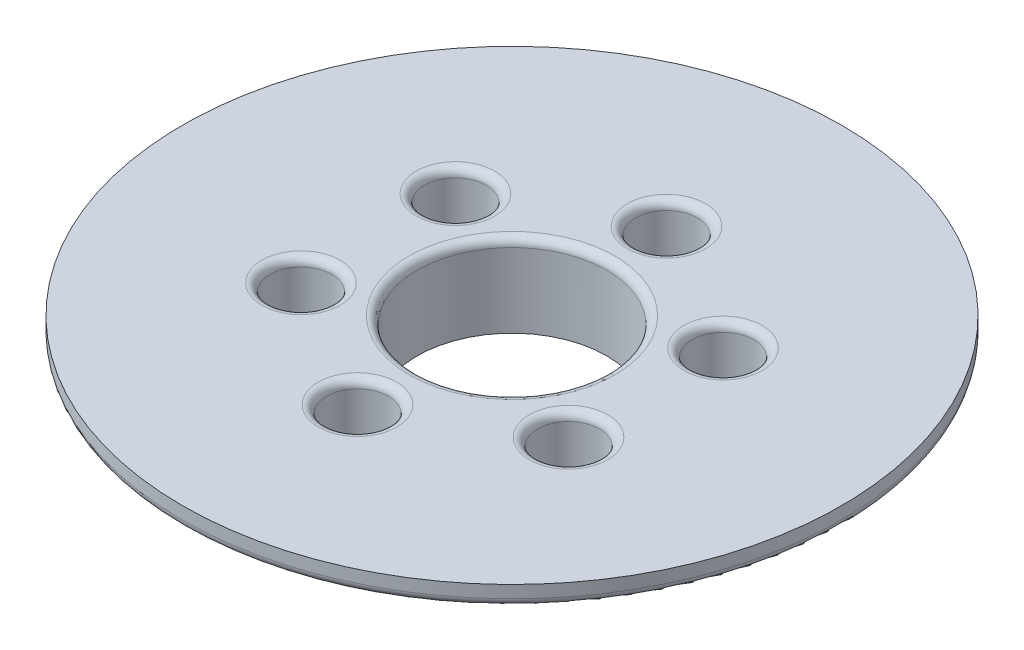
ISO-10303-21;
HEADER;
FILE_DESCRIPTION(('STEP AP214'),'2;1');
FILE_NAME('part.step','',(''),(''),'','','');
FILE_SCHEMA(('AUTOMOTIVE_DESIGN { 1 0 10303 214 1 1 1 1 }'));
ENDSEC;
DATA;
#1=APPLICATION_CONTEXT('core data for automotive mechanical design processes');
#2=APPLICATION_PROTOCOL_DEFINITION('international standard','automotive_design',2000,#1);
#3=PRODUCT_CONTEXT('',#1,'mechanical');
#4=PRODUCT('Part','Part','',(#3));
#5=PRODUCT_RELATED_PRODUCT_CATEGORY('part','',(#4));
#6=PRODUCT_DEFINITION_FORMATION('','',#4);
#7=PRODUCT_DEFINITION_CONTEXT('part definition',#1,'design');
#8=PRODUCT_DEFINITION('design','',#6,#7);
#9=PRODUCT_DEFINITION_SHAPE('','',#8);
#10=(LENGTH_UNIT() NAMED_UNIT(*) SI_UNIT(.MILLI.,.METRE.));
#11=(NAMED_UNIT(*) PLANE_ANGLE_UNIT() SI_UNIT($,.RADIAN.));
#12=(NAMED_UNIT(*) SI_UNIT($,.STERADIAN.) SOLID_ANGLE_UNIT());
#13=UNCERTAINTY_MEASURE_WITH_UNIT(LENGTH_MEASURE(1.E-05),#10,'distance_accuracy_value','');
#14=(GEOMETRIC_REPRESENTATION_CONTEXT(3) GLOBAL_UNCERTAINTY_ASSIGNED_CONTEXT((#13)) GLOBAL_UNIT_ASSIGNED_CONTEXT((#10,
#11,#12)) REPRESENTATION_CONTEXT('',''));
#15=CARTESIAN_POINT('',(0.,0.,0.));
#16=DIRECTION('',(0.,0.,1.));
#17=DIRECTION('',(1.,0.,0.));
#18=AXIS2_PLACEMENT_3D('',#15,#16,#17);
#19=CARTESIAN_POINT('',(20.6222299276173,15.875,11.9062500000006));
#20=DIRECTION('',(0.,-1.,0.));
#21=DIRECTION('',(0.,0.,-1.));
#22=AXIS2_PLACEMENT_3D('',#19,#20,#21);
#23=CYLINDRICAL_SURFACE('',#22,2.66700000000021);
#24=CARTESIAN_POINT('',(20.6222299276173,3.175,11.9062500000006));
#25=DIRECTION('',(0.,-1.,0.));
#26=DIRECTION('',(0.,0.,-1.));
#27=AXIS2_PLACEMENT_3D('',#24,#25,#26);
#28=CIRCLE('',#27,2.66700000000021);
#29=CARTESIAN_POINT('',(20.6222299276173,3.175,9.23925000000037));
#30=VERTEX_POINT('',#29);
#31=EDGE_CURVE('E134',#30,#30,#28,.T.);
#32=ORIENTED_EDGE('',*,*,#31,.T.);
#33=EDGE_LOOP('',(#32));
#34=FACE_BOUND('',#33,.T.);
#35=CARTESIAN_POINT('',(20.6222299276173,7.62,11.9062500000006));
#36=DIRECTION('',(0.,1.,0.));
#37=DIRECTION('',(0.,0.,1.));
#38=AXIS2_PLACEMENT_3D('',#35,#36,#37);
#39=CIRCLE('',#38,2.66700000000021);
#40=CARTESIAN_POINT('',(20.6222299276173,7.62,14.5732500000008));
#41=VERTEX_POINT('',#40);
#42=EDGE_CURVE('E87',#41,#41,#39,.F.);
#43=ORIENTED_EDGE('',*,*,#42,.F.);
#44=EDGE_LOOP('',(#43));
#45=FACE_BOUND('',#44,.T.);
#46=ADVANCED_FACE('F30',(#34,#45),#23,.F.);
#47=CARTESIAN_POINT('',(20.622229927618,15.875,-11.9062499999994));
#48=DIRECTION('',(0.,-1.,0.));
#49=DIRECTION('',(0.,0.,-1.));
#50=AXIS2_PLACEMENT_3D('',#47,#48,#49);
#51=CYLINDRICAL_SURFACE('',#50,2.66700000000091);
#52=CARTESIAN_POINT('',(20.622229927618,3.175,-11.9062499999994));
#53=DIRECTION('',(0.,-1.,0.));
#54=DIRECTION('',(0.,0.,-1.));
#55=AXIS2_PLACEMENT_3D('',#52,#53,#54);
#56=CIRCLE('',#55,2.66700000000091);
#57=CARTESIAN_POINT('',(20.622229927618,3.175,-14.5732500000003));
#58=VERTEX_POINT('',#57);
#59=EDGE_CURVE('E131',#58,#58,#56,.T.);
#60=ORIENTED_EDGE('',*,*,#59,.T.);
#61=EDGE_LOOP('',(#60));
#62=FACE_BOUND('',#61,.T.);
#63=CARTESIAN_POINT('',(20.622229927618,7.62,-11.9062499999994));
#64=DIRECTION('',(0.,1.,0.));
#65=DIRECTION('',(0.,0.,1.));
#66=AXIS2_PLACEMENT_3D('',#63,#64,#65);
#67=CIRCLE('',#66,2.66700000000091);
#68=CARTESIAN_POINT('',(20.622229927618,7.62,-9.23924999999851));
#69=VERTEX_POINT('',#68);
#70=EDGE_CURVE('E91',#69,#69,#67,.F.);
#71=ORIENTED_EDGE('',*,*,#70,.F.);
#72=EDGE_LOOP('',(#71));
#73=FACE_BOUND('',#72,.T.);
#74=ADVANCED_FACE('F177',(#62,#73),#51,.F.);
#75=CARTESIAN_POINT('',(1.34775153124205E-12,15.875,-23.8125));
#76=DIRECTION('',(0.,-1.,0.));
#77=DIRECTION('',(0.,0.,-1.));
#78=AXIS2_PLACEMENT_3D('',#75,#76,#77);
#79=CYLINDRICAL_SURFACE('',#78,2.66700000000145);
#80=CARTESIAN_POINT('',(1.34775153124205E-12,3.175,-23.8125));
#81=DIRECTION('',(0.,-1.,0.));
#82=DIRECTION('',(0.,0.,-1.));
#83=AXIS2_PLACEMENT_3D('',#80,#81,#82);
#84=CIRCLE('',#83,2.66700000000145);
#85=CARTESIAN_POINT('',(1.34775153124205E-12,3.175,-26.4795000000014));
#86=VERTEX_POINT('',#85);
#87=EDGE_CURVE('E128',#86,#86,#84,.T.);
#88=ORIENTED_EDGE('',*,*,#87,.T.);
#89=EDGE_LOOP('',(#88));
#90=FACE_BOUND('',#89,.T.);
#91=CARTESIAN_POINT('',(1.34775153124205E-12,7.62,-23.8125));
#92=DIRECTION('',(0.,1.,0.));
#93=DIRECTION('',(0.,0.,1.));
#94=AXIS2_PLACEMENT_3D('',#91,#92,#93);
#95=CIRCLE('',#94,2.66700000000145);
#96=CARTESIAN_POINT('',(1.34775153124205E-12,7.62,-21.1454999999986));
#97=VERTEX_POINT('',#96);
#98=EDGE_CURVE('E94',#97,#97,#95,.F.);
#99=ORIENTED_EDGE('',*,*,#98,.F.);
#100=EDGE_LOOP('',(#99));
#101=FACE_BOUND('',#100,.T.);
#102=ADVANCED_FACE('F183',(#90,#101),#79,.F.);
#103=CARTESIAN_POINT('',(-20.6222299276159,15.875,-11.9062500000006));
#104=DIRECTION('',(0.,-1.,0.));
#105=DIRECTION('',(0.,0.,-1.));
#106=AXIS2_PLACEMENT_3D('',#103,#104,#105);
#107=CYLINDRICAL_SURFACE('',#106,2.66700000000136);
#108=CARTESIAN_POINT('',(-20.6222299276159,3.175,-11.9062500000006));
#109=DIRECTION('',(0.,-1.,0.));
#110=DIRECTION('',(0.,0.,-1.));
#111=AXIS2_PLACEMENT_3D('',#108,#109,#110);
#112=CIRCLE('',#111,2.66700000000136);
#113=CARTESIAN_POINT('',(-20.6222299276159,3.175,-14.5732500000019));
#114=VERTEX_POINT('',#113);
#115=EDGE_CURVE('E125',#114,#114,#112,.T.);
#116=ORIENTED_EDGE('',*,*,#115,.T.);
#117=EDGE_LOOP('',(#116));
#118=FACE_BOUND('',#117,.T.);
#119=CARTESIAN_POINT('',(-20.6222299276159,7.62,-11.9062500000006));
#120=DIRECTION('',(0.,1.,0.));
#121=DIRECTION('',(0.,0.,1.));
#122=AXIS2_PLACEMENT_3D('',#119,#120,#121);
#123=CIRCLE('',#122,2.66700000000136);
#124=CARTESIAN_POINT('',(-20.6222299276159,7.62,-9.23924999999924));
#125=VERTEX_POINT('',#124);
#126=EDGE_CURVE('E97',#125,#125,#123,.F.);
#127=ORIENTED_EDGE('',*,*,#126,.F.);
#128=EDGE_LOOP('',(#127));
#129=FACE_BOUND('',#128,.T.);
#130=ADVANCED_FACE('F193',(#118,#129),#107,.F.);
#131=CARTESIAN_POINT('',(-20.6222299276166,15.875,11.9062499999994));
#132=DIRECTION('',(0.,-1.,0.));
#133=DIRECTION('',(0.,0.,-1.));
#134=AXIS2_PLACEMENT_3D('',#131,#132,#133);
#135=CYLINDRICAL_SURFACE('',#134,2.66700000000078);
#136=CARTESIAN_POINT('',(-20.6222299276166,3.175,11.9062499999994));
#137=DIRECTION('',(0.,-1.,0.));
#138=DIRECTION('',(0.,0.,-1.));
#139=AXIS2_PLACEMENT_3D('',#136,#137,#138);
#140=CIRCLE('',#139,2.66700000000078);
#141=CARTESIAN_POINT('',(-20.6222299276166,3.175,9.23924999999862));
#142=VERTEX_POINT('',#141);
#143=EDGE_CURVE('E90',#142,#142,#140,.T.);
#144=ORIENTED_EDGE('',*,*,#143,.T.);
#145=EDGE_LOOP('',(#144));
#146=FACE_BOUND('',#145,.T.);
#147=CARTESIAN_POINT('',(-20.6222299276166,7.62,11.9062499999994));
#148=DIRECTION('',(0.,1.,0.));
#149=DIRECTION('',(0.,0.,1.));
#150=AXIS2_PLACEMENT_3D('',#147,#148,#149);
#151=CIRCLE('',#150,2.66700000000078);
#152=CARTESIAN_POINT('',(-20.6222299276166,7.62,14.5732500000002));
#153=VERTEX_POINT('',#152);
#154=EDGE_CURVE('E100',#153,#153,#151,.F.);
#155=ORIENTED_EDGE('',*,*,#154,.F.);
#156=EDGE_LOOP('',(#155));
#157=FACE_BOUND('',#156,.T.);
#158=ADVANCED_FACE('F188',(#146,#157),#135,.F.);
#159=CARTESIAN_POINT('',(0.,15.875,23.8125));
#160=DIRECTION('',(0.,-1.,0.));
#161=DIRECTION('',(0.,0.,-1.));
#162=AXIS2_PLACEMENT_3D('',#159,#160,#161);
#163=CYLINDRICAL_SURFACE('',#162,2.667);
#164=CARTESIAN_POINT('',(0.,3.175,23.8125));
#165=DIRECTION('',(0.,-1.,0.));
#166=DIRECTION('',(0.,0.,-1.));
#167=AXIS2_PLACEMENT_3D('',#164,#165,#166);
#168=CIRCLE('',#167,2.667);
#169=CARTESIAN_POINT('',(0.,3.175,21.1455));
#170=VERTEX_POINT('',#169);
#171=EDGE_CURVE('E124',#170,#170,#168,.T.);
#172=ORIENTED_EDGE('',*,*,#171,.T.);
#173=EDGE_LOOP('',(#172));
#174=FACE_BOUND('',#173,.T.);
#175=CARTESIAN_POINT('',(0.,7.62,23.8125));
#176=DIRECTION('',(0.,1.,0.));
#177=DIRECTION('',(0.,0.,1.));
#178=AXIS2_PLACEMENT_3D('',#175,#176,#177);
#179=CIRCLE('',#178,2.667);
#180=CARTESIAN_POINT('',(0.,7.62,26.4795));
#181=VERTEX_POINT('',#180);
#182=EDGE_CURVE('E103',#181,#181,#179,.F.);
#183=ORIENTED_EDGE('',*,*,#182,.F.);
#184=EDGE_LOOP('',(#183));
#185=FACE_BOUND('',#184,.T.);
#186=ADVANCED_FACE('F223',(#174,#185),#163,.F.);
#187=CARTESIAN_POINT('',(0.,0.,0.));
#188=DIRECTION('',(0.,1.,0.));
#189=DIRECTION('',(0.,0.,1.));
#190=AXIS2_PLACEMENT_3D('',#187,#188,#189);
#191=PLANE('',#190);
#192=CARTESIAN_POINT('',(0.,0.,0.));
#193=DIRECTION('',(0.,1.,0.));
#194=DIRECTION('',(0.,0.,1.));
#195=AXIS2_PLACEMENT_3D('',#192,#193,#194);
#196=CIRCLE('',#195,31.75);
#197=CARTESIAN_POINT('',(0.,0.,31.75));
#198=VERTEX_POINT('',#197);
#199=EDGE_CURVE('E86',#198,#198,#196,.T.);
#200=ORIENTED_EDGE('',*,*,#199,.F.);
#201=EDGE_LOOP('',(#200));
#202=FACE_BOUND('',#201,.T.);
#203=CARTESIAN_POINT('',(0.,0.,0.));
#204=DIRECTION('',(0.,1.,0.));
#205=DIRECTION('',(0.,0.,1.));
#206=AXIS2_PLACEMENT_3D('',#203,#204,#205);
#207=CIRCLE('',#206,29.21);
#208=CARTESIAN_POINT('',(0.,0.,29.21));
#209=VERTEX_POINT('',#208);
#210=EDGE_CURVE('E109',#209,#209,#207,.T.);
#211=ORIENTED_EDGE('',*,*,#210,.T.);
#212=EDGE_LOOP('',(#211));
#213=FACE_BOUND('',#212,.T.);
#214=ADVANCED_FACE('F220',(#202,#213),#191,.F.);
#215=CARTESIAN_POINT('',(0.,3.175,0.));
#216=DIRECTION('',(0.,-1.,0.));
#217=DIRECTION('',(0.,0.,-1.));
#218=AXIS2_PLACEMENT_3D('',#215,#216,#217);
#219=CYLINDRICAL_SURFACE('',#218,31.75);
#220=ORIENTED_EDGE('',*,*,#199,.T.);
#221=EDGE_LOOP('',(#220));
#222=FACE_BOUND('',#221,.T.);
#223=CARTESIAN_POINT('',(0.,12.7,0.));
#224=DIRECTION('',(0.,1.,0.));
#225=DIRECTION('',(0.,0.,1.));
#226=AXIS2_PLACEMENT_3D('',#223,#224,#225);
#227=CIRCLE('',#226,31.75);
#228=CARTESIAN_POINT('',(0.,12.7,31.75));
#229=VERTEX_POINT('',#228);
#230=EDGE_CURVE('E115',#229,#229,#227,.T.);
#231=ORIENTED_EDGE('',*,*,#230,.F.);
#232=EDGE_LOOP('',(#231));
#233=FACE_BOUND('',#232,.T.);
#234=ADVANCED_FACE('F218',(#222,#233),#219,.T.);
#235=CARTESIAN_POINT('',(0.,3.175,0.));
#236=DIRECTION('',(0.,-1.,0.));
#237=DIRECTION('',(0.,0.,-1.));
#238=AXIS2_PLACEMENT_3D('',#235,#236,#237);
#239=CYLINDRICAL_SURFACE('',#238,29.21);
#240=CARTESIAN_POINT('',(0.,3.175,0.));
#241=DIRECTION('',(0.,1.,0.));
#242=DIRECTION('',(0.,0.,1.));
#243=AXIS2_PLACEMENT_3D('',#240,#241,#242);
#244=CIRCLE('',#243,29.21);
#245=CARTESIAN_POINT('',(0.,3.175,29.21));
#246=VERTEX_POINT('',#245);
#247=EDGE_CURVE('E112',#246,#246,#244,.T.);
#248=ORIENTED_EDGE('',*,*,#247,.T.);
#249=EDGE_LOOP('',(#248));
#250=FACE_BOUND('',#249,.T.);
#251=ORIENTED_EDGE('',*,*,#210,.F.);
#252=EDGE_LOOP('',(#251));
#253=FACE_BOUND('',#252,.T.);
#254=ADVANCED_FACE('F214',(#250,#253),#239,.F.);
#255=CARTESIAN_POINT('',(0.,3.175,0.));
#256=DIRECTION('',(0.,1.,0.));
#257=DIRECTION('',(0.,0.,1.));
#258=AXIS2_PLACEMENT_3D('',#255,#256,#257);
#259=PLANE('',#258);
#260=ORIENTED_EDGE('',*,*,#171,.F.);
#261=EDGE_LOOP('',(#260));
#262=FACE_BOUND('',#261,.T.);
#263=ORIENTED_EDGE('',*,*,#143,.F.);
#264=EDGE_LOOP('',(#263));
#265=FACE_BOUND('',#264,.T.);
#266=ORIENTED_EDGE('',*,*,#115,.F.);
#267=EDGE_LOOP('',(#266));
#268=FACE_BOUND('',#267,.T.);
#269=ORIENTED_EDGE('',*,*,#87,.F.);
#270=EDGE_LOOP('',(#269));
#271=FACE_BOUND('',#270,.T.);
#272=ORIENTED_EDGE('',*,*,#59,.F.);
#273=EDGE_LOOP('',(#272));
#274=FACE_BOUND('',#273,.T.);
#275=ORIENTED_EDGE('',*,*,#31,.F.);
#276=EDGE_LOOP('',(#275));
#277=FACE_BOUND('',#276,.T.);
#278=CARTESIAN_POINT('',(0.,3.175,0.));
#279=DIRECTION('',(0.,-1.,0.));
#280=DIRECTION('',(0.,0.,-1.));
#281=AXIS2_PLACEMENT_3D('',#278,#279,#280);
#282=CIRCLE('',#281,14.605);
#283=CARTESIAN_POINT('',(0.,3.175,-14.605));
#284=VERTEX_POINT('',#283);
#285=EDGE_CURVE('E118',#284,#284,#282,.T.);
#286=ORIENTED_EDGE('',*,*,#285,.F.);
#287=EDGE_LOOP('',(#286));
#288=FACE_BOUND('',#287,.T.);
#289=ORIENTED_EDGE('',*,*,#247,.F.);
#290=EDGE_LOOP('',(#289));
#291=FACE_BOUND('',#290,.T.);
#292=ADVANCED_FACE('F210',(#262,#265,#268,#271,#274,#277,#288,#291),#259,.F.);
#293=CARTESIAN_POINT('',(0.,12.7,0.));
#294=DIRECTION('',(0.,-1.,0.));
#295=DIRECTION('',(0.,0.,-1.));
#296=AXIS2_PLACEMENT_3D('',#293,#294,#295);
#297=CYLINDRICAL_SURFACE('',#296,14.605);
#298=CARTESIAN_POINT('',(0.,14.605,0.));
#299=DIRECTION('',(0.,1.,0.));
#300=DIRECTION('',(0.,0.,1.));
#301=AXIS2_PLACEMENT_3D('',#298,#299,#300);
#302=CIRCLE('',#301,14.605);
#303=CARTESIAN_POINT('',(0.,14.605,14.605));
#304=VERTEX_POINT('',#303);
#305=EDGE_CURVE('E83',#304,#304,#302,.T.);
#306=ORIENTED_EDGE('',*,*,#305,.T.);
#307=EDGE_LOOP('',(#306));
#308=FACE_BOUND('',#307,.T.);
#309=ORIENTED_EDGE('',*,*,#285,.T.);
#310=EDGE_LOOP('',(#309));
#311=FACE_BOUND('',#310,.T.);
#312=ADVANCED_FACE('F202',(#308,#311),#297,.F.);
#313=CARTESIAN_POINT('',(0.,15.875,0.));
#314=DIRECTION('',(0.,1.,0.));
#315=DIRECTION('',(0.,0.,1.));
#316=AXIS2_PLACEMENT_3D('',#313,#314,#315);
#317=PLANE('',#316);
#318=CARTESIAN_POINT('',(0.,15.875,0.));
#319=DIRECTION('',(0.,1.,0.));
#320=DIRECTION('',(0.,0.,1.));
#321=AXIS2_PLACEMENT_3D('',#318,#319,#320);
#322=CIRCLE('',#321,15.875);
#323=CARTESIAN_POINT('',(0.,15.875,15.875));
#324=VERTEX_POINT('',#323);
#325=EDGE_CURVE('E62',#324,#324,#322,.F.);
#326=ORIENTED_EDGE('',*,*,#325,.T.);
#327=EDGE_LOOP('',(#326));
#328=FACE_BOUND('',#327,.T.);
#329=CARTESIAN_POINT('',(-4.02455846426619E-13,15.875,23.8125000000006));
#330=DIRECTION('',(0.,1.,0.));
#331=DIRECTION('',(0.,0.,1.));
#332=AXIS2_PLACEMENT_3D('',#329,#330,#331);
#333=CIRCLE('',#332,6.0325);
#334=CARTESIAN_POINT('',(-4.02455846426619E-13,15.875,29.8450000000006));
#335=VERTEX_POINT('',#334);
#336=EDGE_CURVE('E65',#335,#335,#333,.F.);
#337=ORIENTED_EDGE('',*,*,#336,.T.);
#338=EDGE_LOOP('',(#337));
#339=FACE_BOUND('',#338,.T.);
#340=CARTESIAN_POINT('',(-20.6222299276177,15.875,11.9062499999999));
#341=DIRECTION('',(0.,1.,0.));
#342=DIRECTION('',(0.,0.,1.));
#343=AXIS2_PLACEMENT_3D('',#340,#341,#342);
#344=CIRCLE('',#343,6.0325);
#345=CARTESIAN_POINT('',(-20.6222299276177,15.875,17.9387499999999));
#346=VERTEX_POINT('',#345);
#347=EDGE_CURVE('E68',#346,#346,#344,.F.);
#348=ORIENTED_EDGE('',*,*,#347,.T.);
#349=EDGE_LOOP('',(#348));
#350=FACE_BOUND('',#349,.T.);
#351=CARTESIAN_POINT('',(-20.6222299276172,15.875,-11.9062500000007));
#352=DIRECTION('',(0.,1.,0.));
#353=DIRECTION('',(0.,0.,1.));
#354=AXIS2_PLACEMENT_3D('',#351,#352,#353);
#355=CIRCLE('',#354,6.0325);
#356=CARTESIAN_POINT('',(-20.6222299276172,15.875,-5.87375000000073));
#357=VERTEX_POINT('',#356);
#358=EDGE_CURVE('E71',#357,#357,#355,.F.);
#359=ORIENTED_EDGE('',*,*,#358,.T.);
#360=EDGE_LOOP('',(#359));
#361=FACE_BOUND('',#360,.T.);
#362=CARTESIAN_POINT('',(5.65519853168439E-13,15.875,-23.8125000000006));
#363=DIRECTION('',(0.,1.,0.));
#364=DIRECTION('',(0.,0.,1.));
#365=AXIS2_PLACEMENT_3D('',#362,#363,#364);
#366=CIRCLE('',#365,6.0325);
#367=CARTESIAN_POINT('',(5.65519853168439E-13,15.875,-17.7800000000006));
#368=VERTEX_POINT('',#367);
#369=EDGE_CURVE('E74',#368,#368,#366,.F.);
#370=ORIENTED_EDGE('',*,*,#369,.T.);
#371=EDGE_LOOP('',(#370));
#372=FACE_BOUND('',#371,.T.);
#373=CARTESIAN_POINT('',(20.6222299276173,15.875,11.9062500000006));
#374=DIRECTION('',(0.,1.,0.));
#375=DIRECTION('',(0.,0.,1.));
#376=AXIS2_PLACEMENT_3D('',#373,#374,#375);
#377=CIRCLE('',#376,6.0325);
#378=CARTESIAN_POINT('',(20.6222299276173,15.875,17.9387500000006));
#379=VERTEX_POINT('',#378);
#380=EDGE_CURVE('E77',#379,#379,#377,.F.);
#381=ORIENTED_EDGE('',*,*,#380,.T.);
#382=EDGE_LOOP('',(#381));
#383=FACE_BOUND('',#382,.T.);
#384=CARTESIAN_POINT('',(20.6222299276178,15.875,-11.9062499999998));
#385=DIRECTION('',(0.,1.,0.));
#386=DIRECTION('',(0.,0.,1.));
#387=AXIS2_PLACEMENT_3D('',#384,#385,#386);
#388=CIRCLE('',#387,6.0325);
#389=CARTESIAN_POINT('',(20.6222299276178,15.875,-5.87374999999975));
#390=VERTEX_POINT('',#389);
#391=EDGE_CURVE('E80',#390,#390,#388,.F.);
#392=ORIENTED_EDGE('',*,*,#391,.T.);
#393=EDGE_LOOP('',(#392));
#394=FACE_BOUND('',#393,.T.);
#395=CARTESIAN_POINT('',(0.,15.875,0.));
#396=DIRECTION('',(0.,1.,0.));
#397=DIRECTION('',(0.,0.,1.));
#398=AXIS2_PLACEMENT_3D('',#395,#396,#397);
#399=CIRCLE('',#398,50.8);
#400=CARTESIAN_POINT('',(0.,15.875,50.8));
#401=VERTEX_POINT('',#400);
#402=EDGE_CURVE('E121',#401,#401,#399,.T.);
#403=ORIENTED_EDGE('',*,*,#402,.T.);
#404=EDGE_LOOP('',(#403));
#405=FACE_BOUND('',#404,.T.);
#406=ADVANCED_FACE('F198',(#328,#339,#350,#361,#372,#383,#394,#405),#317,.T.);
#407=CARTESIAN_POINT('',(0.,12.7,0.));
#408=DIRECTION('',(0.,1.,0.));
#409=DIRECTION('',(0.,0.,1.));
#410=AXIS2_PLACEMENT_3D('',#407,#408,#409);
#411=PLANE('',#410);
#412=CARTESIAN_POINT('',(0.,12.7,0.));
#413=DIRECTION('',(0.,1.,0.));
#414=DIRECTION('',(0.,0.,1.));
#415=AXIS2_PLACEMENT_3D('',#412,#413,#414);
#416=CIRCLE('',#415,49.53);
#417=CARTESIAN_POINT('',(0.,12.7,49.53));
#418=VERTEX_POINT('',#417);
#419=EDGE_CURVE('E10',#418,#418,#416,.F.);
#420=ORIENTED_EDGE('',*,*,#419,.T.);
#421=EDGE_LOOP('',(#420));
#422=FACE_BOUND('',#421,.T.);
#423=ORIENTED_EDGE('',*,*,#230,.T.);
#424=EDGE_LOOP('',(#423));
#425=FACE_BOUND('',#424,.T.);
#426=ADVANCED_FACE('F201',(#422,#425),#411,.F.);
#427=CARTESIAN_POINT('',(0.,15.875,0.));
#428=DIRECTION('',(0.,-1.,0.));
#429=DIRECTION('',(0.,0.,-1.));
#430=AXIS2_PLACEMENT_3D('',#427,#428,#429);
#431=CYLINDRICAL_SURFACE('',#430,50.8);
#432=CARTESIAN_POINT('',(0.,13.97,0.));
#433=DIRECTION('',(0.,1.,0.));
#434=DIRECTION('',(0.,0.,1.));
#435=AXIS2_PLACEMENT_3D('',#432,#433,#434);
#436=CIRCLE('',#435,50.8);
#437=CARTESIAN_POINT('',(0.,13.97,50.8));
#438=VERTEX_POINT('',#437);
#439=EDGE_CURVE('E37',#438,#438,#436,.T.);
#440=ORIENTED_EDGE('',*,*,#439,.T.);
#441=EDGE_LOOP('',(#440));
#442=FACE_BOUND('',#441,.T.);
#443=ORIENTED_EDGE('',*,*,#402,.F.);
#444=EDGE_LOOP('',(#443));
#445=FACE_BOUND('',#444,.T.);
#446=ADVANCED_FACE('F174',(#442,#445),#431,.T.);
#447=CARTESIAN_POINT('',(-4.02455846426619E-13,7.62,23.8125000000006));
#448=DIRECTION('',(0.,1.,0.));
#449=DIRECTION('',(0.,0.,1.));
#450=AXIS2_PLACEMENT_3D('',#447,#448,#449);
#451=PLANE('',#450);
#452=CARTESIAN_POINT('',(-4.02455846426619E-13,7.62,23.8125000000006));
#453=DIRECTION('',(0.,1.,0.));
#454=DIRECTION('',(0.,0.,1.));
#455=AXIS2_PLACEMENT_3D('',#452,#453,#454);
#456=CIRCLE('',#455,4.7625);
#457=CARTESIAN_POINT('',(-4.02455846426619E-13,7.62,28.5750000000006));
#458=VERTEX_POINT('',#457);
#459=EDGE_CURVE('E143',#458,#458,#456,.T.);
#460=ORIENTED_EDGE('',*,*,#459,.T.);
#461=EDGE_LOOP('',(#460));
#462=FACE_BOUND('',#461,.T.);
#463=ORIENTED_EDGE('',*,*,#182,.T.);
#464=EDGE_LOOP('',(#463));
#465=FACE_BOUND('',#464,.T.);
#466=ADVANCED_FACE('F159',(#462,#465),#451,.T.);
#467=CARTESIAN_POINT('',(-4.02455846426619E-13,7.62,23.8125000000006));
#468=DIRECTION('',(0.,1.,0.));
#469=DIRECTION('',(0.,0.,1.));
#470=AXIS2_PLACEMENT_3D('',#467,#468,#469);
#471=CYLINDRICAL_SURFACE('',#470,4.7625);
#472=CARTESIAN_POINT('',(-4.02455846426619E-13,14.605,23.8125000000006));
#473=DIRECTION('',(0.,1.,0.));
#474=DIRECTION('',(0.,0.,1.));
#475=AXIS2_PLACEMENT_3D('',#472,#473,#474);
#476=CIRCLE('',#475,4.7625);
#477=CARTESIAN_POINT('',(-4.02455846426619E-13,14.605,28.5750000000006));
#478=VERTEX_POINT('',#477);
#479=EDGE_CURVE('E59',#478,#478,#476,.T.);
#480=ORIENTED_EDGE('',*,*,#479,.T.);
#481=EDGE_LOOP('',(#480));
#482=FACE_BOUND('',#481,.T.);
#483=ORIENTED_EDGE('',*,*,#459,.F.);
#484=EDGE_LOOP('',(#483));
#485=FACE_BOUND('',#484,.T.);
#486=ADVANCED_FACE('F162',(#482,#485),#471,.F.);
#487=CARTESIAN_POINT('',(-20.6222299276177,7.62,11.9062499999999));
#488=DIRECTION('',(0.,1.,0.));
#489=DIRECTION('',(0.,0.,1.));
#490=AXIS2_PLACEMENT_3D('',#487,#488,#489);
#491=PLANE('',#490);
#492=CARTESIAN_POINT('',(-20.6222299276177,7.62,11.9062499999999));
#493=DIRECTION('',(0.,1.,0.));
#494=DIRECTION('',(0.,0.,1.));
#495=AXIS2_PLACEMENT_3D('',#492,#493,#494);
#496=CIRCLE('',#495,4.7625);
#497=CARTESIAN_POINT('',(-20.6222299276177,7.62,16.6687499999999));
#498=VERTEX_POINT('',#497);
#499=EDGE_CURVE('E153',#498,#498,#496,.T.);
#500=ORIENTED_EDGE('',*,*,#499,.T.);
#501=EDGE_LOOP('',(#500));
#502=FACE_BOUND('',#501,.T.);
#503=ORIENTED_EDGE('',*,*,#154,.T.);
#504=EDGE_LOOP('',(#503));
#505=FACE_BOUND('',#504,.T.);
#506=ADVANCED_FACE('F164',(#502,#505),#491,.T.);
#507=CARTESIAN_POINT('',(-20.6222299276177,7.62,11.9062499999999));
#508=DIRECTION('',(0.,1.,0.));
#509=DIRECTION('',(0.,0.,1.));
#510=AXIS2_PLACEMENT_3D('',#507,#508,#509);
#511=CYLINDRICAL_SURFACE('',#510,4.7625);
#512=CARTESIAN_POINT('',(-20.6222299276177,14.605,11.9062499999999));
#513=DIRECTION('',(0.,1.,0.));
#514=DIRECTION('',(0.,0.,1.));
#515=AXIS2_PLACEMENT_3D('',#512,#513,#514);
#516=CIRCLE('',#515,4.7625);
#517=CARTESIAN_POINT('',(-20.6222299276177,14.605,16.6687499999999));
#518=VERTEX_POINT('',#517);
#519=EDGE_CURVE('E56',#518,#518,#516,.T.);
#520=ORIENTED_EDGE('',*,*,#519,.T.);
#521=EDGE_LOOP('',(#520));
#522=FACE_BOUND('',#521,.T.);
#523=ORIENTED_EDGE('',*,*,#499,.F.);
#524=EDGE_LOOP('',(#523));
#525=FACE_BOUND('',#524,.T.);
#526=ADVANCED_FACE('F171',(#522,#525),#511,.F.);
#527=CARTESIAN_POINT('',(-20.6222299276172,7.62,-11.9062500000007));
#528=DIRECTION('',(0.,1.,0.));
#529=DIRECTION('',(0.,0.,1.));
#530=AXIS2_PLACEMENT_3D('',#527,#528,#529);
#531=PLANE('',#530);
#532=CARTESIAN_POINT('',(-20.6222299276172,7.62,-11.9062500000007));
#533=DIRECTION('',(0.,1.,0.));
#534=DIRECTION('',(0.,0.,1.));
#535=AXIS2_PLACEMENT_3D('',#532,#533,#534);
#536=CIRCLE('',#535,4.7625);
#537=CARTESIAN_POINT('',(-20.6222299276172,7.62,-7.14375000000073));
#538=VERTEX_POINT('',#537);
#539=EDGE_CURVE('E150',#538,#538,#536,.T.);
#540=ORIENTED_EDGE('',*,*,#539,.T.);
#541=EDGE_LOOP('',(#540));
#542=FACE_BOUND('',#541,.T.);
#543=ORIENTED_EDGE('',*,*,#126,.T.);
#544=EDGE_LOOP('',(#543));
#545=FACE_BOUND('',#544,.T.);
#546=ADVANCED_FACE('F326',(#542,#545),#531,.T.);
#547=CARTESIAN_POINT('',(-20.6222299276172,7.62,-11.9062500000007));
#548=DIRECTION('',(0.,1.,0.));
#549=DIRECTION('',(0.,0.,1.));
#550=AXIS2_PLACEMENT_3D('',#547,#548,#549);
#551=CYLINDRICAL_SURFACE('',#550,4.7625);
#552=CARTESIAN_POINT('',(-20.6222299276172,14.605,-11.9062500000007));
#553=DIRECTION('',(0.,1.,0.));
#554=DIRECTION('',(0.,0.,1.));
#555=AXIS2_PLACEMENT_3D('',#552,#553,#554);
#556=CIRCLE('',#555,4.7625);
#557=CARTESIAN_POINT('',(-20.6222299276172,14.605,-7.14375000000073));
#558=VERTEX_POINT('',#557);
#559=EDGE_CURVE('E53',#558,#558,#556,.T.);
#560=ORIENTED_EDGE('',*,*,#559,.T.);
#561=EDGE_LOOP('',(#560));
#562=FACE_BOUND('',#561,.T.);
#563=ORIENTED_EDGE('',*,*,#539,.F.);
#564=EDGE_LOOP('',(#563));
#565=FACE_BOUND('',#564,.T.);
#566=ADVANCED_FACE('F321',(#562,#565),#551,.F.);
#567=CARTESIAN_POINT('',(5.65519853168439E-13,7.62,-23.8125000000006));
#568=DIRECTION('',(0.,1.,0.));
#569=DIRECTION('',(0.,0.,1.));
#570=AXIS2_PLACEMENT_3D('',#567,#568,#569);
#571=PLANE('',#570);
#572=CARTESIAN_POINT('',(5.65519853168439E-13,7.62,-23.8125000000006));
#573=DIRECTION('',(0.,1.,0.));
#574=DIRECTION('',(0.,0.,1.));
#575=AXIS2_PLACEMENT_3D('',#572,#573,#574);
#576=CIRCLE('',#575,4.7625);
#577=CARTESIAN_POINT('',(5.65519853168439E-13,7.62,-19.0500000000006));
#578=VERTEX_POINT('',#577);
#579=EDGE_CURVE('E147',#578,#578,#576,.T.);
#580=ORIENTED_EDGE('',*,*,#579,.T.);
#581=EDGE_LOOP('',(#580));
#582=FACE_BOUND('',#581,.T.);
#583=ORIENTED_EDGE('',*,*,#98,.T.);
#584=EDGE_LOOP('',(#583));
#585=FACE_BOUND('',#584,.T.);
#586=ADVANCED_FACE('F280',(#582,#585),#571,.T.);
#587=CARTESIAN_POINT('',(5.65519853168439E-13,7.62,-23.8125000000006));
#588=DIRECTION('',(0.,1.,0.));
#589=DIRECTION('',(0.,0.,1.));
#590=AXIS2_PLACEMENT_3D('',#587,#588,#589);
#591=CYLINDRICAL_SURFACE('',#590,4.7625);
#592=CARTESIAN_POINT('',(5.65519853168439E-13,14.605,-23.8125000000006));
#593=DIRECTION('',(0.,1.,0.));
#594=DIRECTION('',(0.,0.,1.));
#595=AXIS2_PLACEMENT_3D('',#592,#593,#594);
#596=CIRCLE('',#595,4.7625);
#597=CARTESIAN_POINT('',(5.65519853168439E-13,14.605,-19.0500000000006));
#598=VERTEX_POINT('',#597);
#599=EDGE_CURVE('E50',#598,#598,#596,.T.);
#600=ORIENTED_EDGE('',*,*,#599,.T.);
#601=EDGE_LOOP('',(#600));
#602=FACE_BOUND('',#601,.T.);
#603=ORIENTED_EDGE('',*,*,#579,.F.);
#604=EDGE_LOOP('',(#603));
#605=FACE_BOUND('',#604,.T.);
#606=ADVANCED_FACE('F273',(#602,#605),#591,.F.);
#607=CARTESIAN_POINT('',(20.6222299276178,7.62,-11.9062499999998));
#608=DIRECTION('',(0.,1.,0.));
#609=DIRECTION('',(0.,0.,1.));
#610=AXIS2_PLACEMENT_3D('',#607,#608,#609);
#611=PLANE('',#610);
#612=CARTESIAN_POINT('',(20.6222299276178,7.62,-11.9062499999998));
#613=DIRECTION('',(0.,1.,0.));
#614=DIRECTION('',(0.,0.,1.));
#615=AXIS2_PLACEMENT_3D('',#612,#613,#614);
#616=CIRCLE('',#615,4.7625);
#617=CARTESIAN_POINT('',(20.6222299276178,7.62,-7.14374999999975));
#618=VERTEX_POINT('',#617);
#619=EDGE_CURVE('E144',#618,#618,#616,.T.);
#620=ORIENTED_EDGE('',*,*,#619,.T.);
#621=EDGE_LOOP('',(#620));
#622=FACE_BOUND('',#621,.T.);
#623=ORIENTED_EDGE('',*,*,#70,.T.);
#624=EDGE_LOOP('',(#623));
#625=FACE_BOUND('',#624,.T.);
#626=ADVANCED_FACE('F267',(#622,#625),#611,.T.);
#627=CARTESIAN_POINT('',(20.6222299276178,7.62,-11.9062499999998));
#628=DIRECTION('',(0.,1.,0.));
#629=DIRECTION('',(0.,0.,1.));
#630=AXIS2_PLACEMENT_3D('',#627,#628,#629);
#631=CYLINDRICAL_SURFACE('',#630,4.7625);
#632=CARTESIAN_POINT('',(20.6222299276178,14.605,-11.9062499999998));
#633=DIRECTION('',(0.,1.,0.));
#634=DIRECTION('',(0.,0.,1.));
#635=AXIS2_PLACEMENT_3D('',#632,#633,#634);
#636=CIRCLE('',#635,4.7625);
#637=CARTESIAN_POINT('',(20.6222299276178,14.605,-7.14374999999975));
#638=VERTEX_POINT('',#637);
#639=EDGE_CURVE('E41',#638,#638,#636,.T.);
#640=ORIENTED_EDGE('',*,*,#639,.T.);
#641=EDGE_LOOP('',(#640));
#642=FACE_BOUND('',#641,.T.);
#643=ORIENTED_EDGE('',*,*,#619,.F.);
#644=EDGE_LOOP('',(#643));
#645=FACE_BOUND('',#644,.T.);
#646=ADVANCED_FACE('F263',(#642,#645),#631,.F.);
#647=CARTESIAN_POINT('',(20.6222299276173,7.62,11.9062500000006));
#648=DIRECTION('',(0.,1.,0.));
#649=DIRECTION('',(0.,0.,1.));
#650=AXIS2_PLACEMENT_3D('',#647,#648,#649);
#651=PLANE('',#650);
#652=CARTESIAN_POINT('',(20.6222299276173,7.62,11.9062500000006));
#653=DIRECTION('',(0.,1.,0.));
#654=DIRECTION('',(0.,0.,1.));
#655=AXIS2_PLACEMENT_3D('',#652,#653,#654);
#656=CIRCLE('',#655,4.7625);
#657=CARTESIAN_POINT('',(20.6222299276173,7.62,16.6687500000006));
#658=VERTEX_POINT('',#657);
#659=EDGE_CURVE('E106',#658,#658,#656,.T.);
#660=ORIENTED_EDGE('',*,*,#659,.T.);
#661=EDGE_LOOP('',(#660));
#662=FACE_BOUND('',#661,.T.);
#663=ORIENTED_EDGE('',*,*,#42,.T.);
#664=EDGE_LOOP('',(#663));
#665=FACE_BOUND('',#664,.T.);
#666=ADVANCED_FACE('F266',(#662,#665),#651,.T.);
#667=CARTESIAN_POINT('',(20.6222299276173,7.62,11.9062500000006));
#668=DIRECTION('',(0.,1.,0.));
#669=DIRECTION('',(0.,0.,1.));
#670=AXIS2_PLACEMENT_3D('',#667,#668,#669);
#671=CYLINDRICAL_SURFACE('',#670,4.7625);
#672=CARTESIAN_POINT('',(20.6222299276173,14.605,11.9062500000006));
#673=DIRECTION('',(0.,1.,0.));
#674=DIRECTION('',(0.,0.,1.));
#675=AXIS2_PLACEMENT_3D('',#672,#673,#674);
#676=CIRCLE('',#675,4.7625);
#677=CARTESIAN_POINT('',(20.6222299276173,14.605,16.6687500000006));
#678=VERTEX_POINT('',#677);
#679=EDGE_CURVE('E45',#678,#678,#676,.T.);
#680=ORIENTED_EDGE('',*,*,#679,.T.);
#681=EDGE_LOOP('',(#680));
#682=FACE_BOUND('',#681,.T.);
#683=ORIENTED_EDGE('',*,*,#659,.F.);
#684=EDGE_LOOP('',(#683));
#685=FACE_BOUND('',#684,.T.);
#686=ADVANCED_FACE('F232',(#682,#685),#671,.F.);
#687=CARTESIAN_POINT('',(0.,14.605,0.));
#688=DIRECTION('',(0.,1.,0.));
#689=DIRECTION('',(0.,0.,1.));
#690=AXIS2_PLACEMENT_3D('',#687,#688,#689);
#691=TOROIDAL_SURFACE('',#690,15.875,1.27);
#692=ORIENTED_EDGE('',*,*,#325,.F.);
#693=EDGE_LOOP('',(#692));
#694=FACE_BOUND('',#693,.T.);
#695=ORIENTED_EDGE('',*,*,#305,.F.);
#696=EDGE_LOOP('',(#695));
#697=FACE_BOUND('',#696,.T.);
#698=ADVANCED_FACE('F228',(#694,#697),#691,.T.);
#699=CARTESIAN_POINT('',(-4.02455846426619E-13,14.605,23.8125000000006));
#700=DIRECTION('',(0.,1.,0.));
#701=DIRECTION('',(0.,0.,1.));
#702=AXIS2_PLACEMENT_3D('',#699,#700,#701);
#703=TOROIDAL_SURFACE('',#702,6.0325,1.27);
#704=ORIENTED_EDGE('',*,*,#336,.F.);
#705=EDGE_LOOP('',(#704));
#706=FACE_BOUND('',#705,.T.);
#707=ORIENTED_EDGE('',*,*,#479,.F.);
#708=EDGE_LOOP('',(#707));
#709=FACE_BOUND('',#708,.T.);
#710=ADVANCED_FACE('F231',(#706,#709),#703,.T.);
#711=CARTESIAN_POINT('',(-20.6222299276177,14.605,11.9062499999999));
#712=DIRECTION('',(0.,1.,0.));
#713=DIRECTION('',(0.,0.,1.));
#714=AXIS2_PLACEMENT_3D('',#711,#712,#713);
#715=TOROIDAL_SURFACE('',#714,6.0325,1.27);
#716=ORIENTED_EDGE('',*,*,#347,.F.);
#717=EDGE_LOOP('',(#716));
#718=FACE_BOUND('',#717,.T.);
#719=ORIENTED_EDGE('',*,*,#519,.F.);
#720=EDGE_LOOP('',(#719));
#721=FACE_BOUND('',#720,.T.);
#722=ADVANCED_FACE('F236',(#718,#721),#715,.T.);
#723=CARTESIAN_POINT('',(-20.6222299276172,14.605,-11.9062500000007));
#724=DIRECTION('',(0.,1.,0.));
#725=DIRECTION('',(0.,0.,1.));
#726=AXIS2_PLACEMENT_3D('',#723,#724,#725);
#727=TOROIDAL_SURFACE('',#726,6.0325,1.27);
#728=ORIENTED_EDGE('',*,*,#358,.F.);
#729=EDGE_LOOP('',(#728));
#730=FACE_BOUND('',#729,.T.);
#731=ORIENTED_EDGE('',*,*,#559,.F.);
#732=EDGE_LOOP('',(#731));
#733=FACE_BOUND('',#732,.T.);
#734=ADVANCED_FACE('F240',(#730,#733),#727,.T.);
#735=CARTESIAN_POINT('',(5.65519853168439E-13,14.605,-23.8125000000006));
#736=DIRECTION('',(0.,1.,0.));
#737=DIRECTION('',(0.,0.,1.));
#738=AXIS2_PLACEMENT_3D('',#735,#736,#737);
#739=TOROIDAL_SURFACE('',#738,6.0325,1.27);
#740=ORIENTED_EDGE('',*,*,#369,.F.);
#741=EDGE_LOOP('',(#740));
#742=FACE_BOUND('',#741,.T.);
#743=ORIENTED_EDGE('',*,*,#599,.F.);
#744=EDGE_LOOP('',(#743));
#745=FACE_BOUND('',#744,.T.);
#746=ADVANCED_FACE('F244',(#742,#745),#739,.T.);
#747=CARTESIAN_POINT('',(20.6222299276173,14.605,11.9062500000006));
#748=DIRECTION('',(0.,1.,0.));
#749=DIRECTION('',(0.,0.,1.));
#750=AXIS2_PLACEMENT_3D('',#747,#748,#749);
#751=TOROIDAL_SURFACE('',#750,6.0325,1.27);
#752=ORIENTED_EDGE('',*,*,#380,.F.);
#753=EDGE_LOOP('',(#752));
#754=FACE_BOUND('',#753,.T.);
#755=ORIENTED_EDGE('',*,*,#679,.F.);
#756=EDGE_LOOP('',(#755));
#757=FACE_BOUND('',#756,.T.);
#758=ADVANCED_FACE('F248',(#754,#757),#751,.T.);
#759=CARTESIAN_POINT('',(20.6222299276178,14.605,-11.9062499999998));
#760=DIRECTION('',(0.,1.,0.));
#761=DIRECTION('',(0.,0.,1.));
#762=AXIS2_PLACEMENT_3D('',#759,#760,#761);
#763=TOROIDAL_SURFACE('',#762,6.0325,1.27);
#764=ORIENTED_EDGE('',*,*,#391,.F.);
#765=EDGE_LOOP('',(#764));
#766=FACE_BOUND('',#765,.T.);
#767=ORIENTED_EDGE('',*,*,#639,.F.);
#768=EDGE_LOOP('',(#767));
#769=FACE_BOUND('',#768,.T.);
#770=ADVANCED_FACE('F251',(#766,#769),#763,.T.);
#771=CARTESIAN_POINT('',(0.,13.97,0.));
#772=DIRECTION('',(0.,1.,0.));
#773=DIRECTION('',(0.,0.,1.));
#774=AXIS2_PLACEMENT_3D('',#771,#772,#773);
#775=TOROIDAL_SURFACE('',#774,49.53,1.27);
#776=ORIENTED_EDGE('',*,*,#419,.F.);
#777=EDGE_LOOP('',(#776));
#778=FACE_BOUND('',#777,.T.);
#779=ORIENTED_EDGE('',*,*,#439,.F.);
#780=EDGE_LOOP('',(#779));
#781=FACE_BOUND('',#780,.T.);
#782=ADVANCED_FACE('F32',(#778,#781),#775,.T.);
#783=CLOSED_SHELL('',(#46,#74,#102,#130,#158,#186,#214,#234,#254,#292,#312,#406,#426,#446,#466,
#486,#506,#526,#546,#566,#586,#606,#626,#646,#666,#686,#698,#710,#722,#734,#746,#758,#770,#782));
#784=MANIFOLD_SOLID_BREP('B2',#783);
#785=ADVANCED_BREP_SHAPE_REPRESENTATION('',(#18,#784),#14);
#786=SHAPE_DEFINITION_REPRESENTATION(#9,#785);
ENDSEC;
END-ISO-10303-21;
